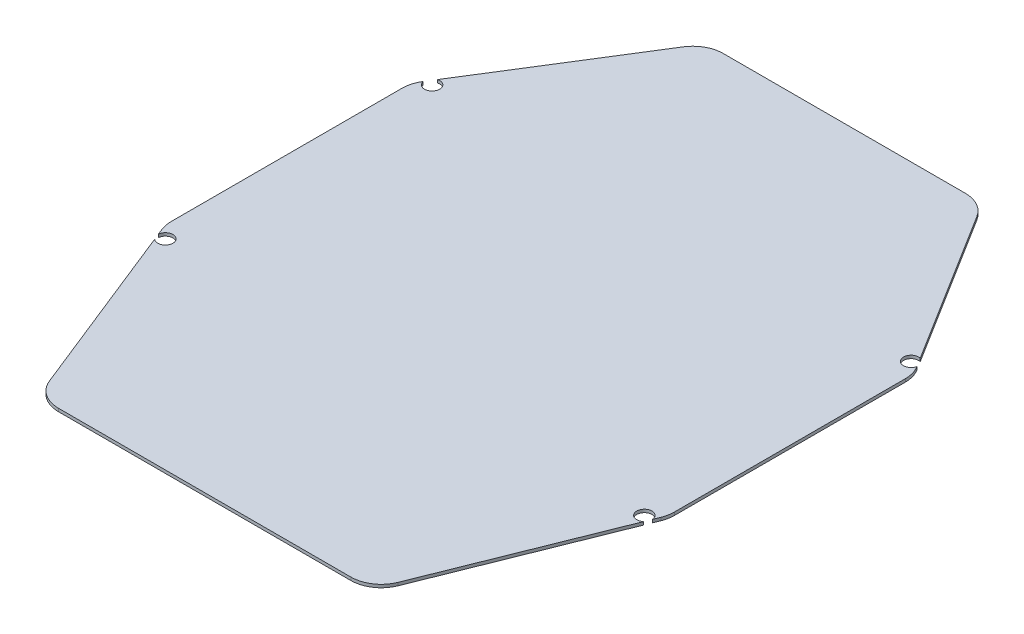
ISO-10303-21;
HEADER;
FILE_DESCRIPTION(('STEP AP214'),'2;1');
FILE_NAME('part.step','',(''),(''),'','','');
FILE_SCHEMA(('AUTOMOTIVE_DESIGN { 1 0 10303 214 1 1 1 1 }'));
ENDSEC;
DATA;
#1=APPLICATION_CONTEXT('core data for automotive mechanical design processes');
#2=APPLICATION_PROTOCOL_DEFINITION('international standard','automotive_design',2000,#1);
#3=PRODUCT_CONTEXT('',#1,'mechanical');
#4=PRODUCT('Part','Part','',(#3));
#5=PRODUCT_RELATED_PRODUCT_CATEGORY('part','',(#4));
#6=PRODUCT_DEFINITION_FORMATION('','',#4);
#7=PRODUCT_DEFINITION_CONTEXT('part definition',#1,'design');
#8=PRODUCT_DEFINITION('design','',#6,#7);
#9=PRODUCT_DEFINITION_SHAPE('','',#8);
#10=(LENGTH_UNIT() NAMED_UNIT(*) SI_UNIT(.MILLI.,.METRE.));
#11=(NAMED_UNIT(*) PLANE_ANGLE_UNIT() SI_UNIT($,.RADIAN.));
#12=(NAMED_UNIT(*) SI_UNIT($,.STERADIAN.) SOLID_ANGLE_UNIT());
#13=UNCERTAINTY_MEASURE_WITH_UNIT(LENGTH_MEASURE(1.E-05),#10,'distance_accuracy_value','');
#14=(GEOMETRIC_REPRESENTATION_CONTEXT(3) GLOBAL_UNCERTAINTY_ASSIGNED_CONTEXT((#13)) GLOBAL_UNIT_ASSIGNED_CONTEXT((#10,
#11,#12)) REPRESENTATION_CONTEXT('',''));
#15=CARTESIAN_POINT('',(0.,0.,0.));
#16=DIRECTION('',(0.,0.,1.));
#17=DIRECTION('',(1.,0.,0.));
#18=AXIS2_PLACEMENT_3D('',#15,#16,#17);
#19=CARTESIAN_POINT('',(81.4799830400509,1.,-47.9320271359186));
#20=DIRECTION('',(-0.847998304005088,0.,0.52999894000318));
#21=DIRECTION('',(0.52999894000318,0.,0.847998304005088));
#22=AXIS2_PLACEMENT_3D('',#19,#20,#21);
#23=PLANE('',#22);
#24=DIRECTION('',(-0.52999894000318,0.,-0.847998304005088));
#25=VECTOR('',#24,1.);
#26=CARTESIAN_POINT('',(81.4799830400509,0.,-47.9320271359186));
#27=LINE('',#26,#25);
#28=CARTESIAN_POINT('',(81.4799830400509,0.,-47.9320271359186));
#29=VERTEX_POINT('',#28);
#30=CARTESIAN_POINT('',(81.4418787234434,0.,-47.9929940424907));
#31=VERTEX_POINT('',#30);
#32=EDGE_CURVE('E231',#29,#31,#27,.T.);
#33=ORIENTED_EDGE('',*,*,#32,.T.);
#34=DIRECTION('',(0.,1.,0.));
#35=VECTOR('',#34,1.);
#36=CARTESIAN_POINT('',(81.4418787234434,0.,-47.9929940424907));
#37=LINE('',#36,#35);
#38=CARTESIAN_POINT('',(81.4418787234434,1.,-47.9929940424907));
#39=VERTEX_POINT('',#38);
#40=EDGE_CURVE('E59',#31,#39,#37,.T.);
#41=ORIENTED_EDGE('',*,*,#40,.T.);
#42=DIRECTION('',(-0.52999894000318,0.,-0.847998304005088));
#43=VECTOR('',#42,1.);
#44=CARTESIAN_POINT('',(81.4799830400509,1.,-47.9320271359186));
#45=LINE('',#44,#43);
#46=CARTESIAN_POINT('',(81.4799830400509,1.,-47.9320271359186));
#47=VERTEX_POINT('',#46);
#48=EDGE_CURVE('E375',#47,#39,#45,.T.);
#49=ORIENTED_EDGE('',*,*,#48,.F.);
#50=DIRECTION('',(0.,-1.,0.));
#51=VECTOR('',#50,1.);
#52=CARTESIAN_POINT('',(81.4799830400509,1.,-47.9320271359186));
#53=LINE('',#52,#51);
#54=EDGE_CURVE('E334',#47,#29,#53,.T.);
#55=ORIENTED_EDGE('',*,*,#54,.T.);
#56=EDGE_LOOP('',(#33,#41,#49,#55));
#57=FACE_BOUND('',#56,.T.);
#58=ADVANCED_FACE('F43',(#57),#23,.F.);
#59=CARTESIAN_POINT('',(-48.4375066249802,1.,-100.799989400032));
#60=DIRECTION('',(0.847998304005088,0.,0.52999894000318));
#61=DIRECTION('',(0.52999894000318,0.,-0.847998304005088));
#62=AXIS2_PLACEMENT_3D('',#59,#60,#61);
#63=PLANE('',#62);
#64=DIRECTION('',(-0.52999894000318,0.,0.847998304005088));
#65=VECTOR('',#64,1.);
#66=CARTESIAN_POINT('',(-48.4375066249802,0.,-100.799989400032));
#67=LINE('',#66,#65);
#68=CARTESIAN_POINT('',(-48.4375066249802,0.,-100.799989400032));
#69=VERTEX_POINT('',#68);
#70=CARTESIAN_POINT('',(-79.5882957612491,0.,-50.9587267820014));
#71=VERTEX_POINT('',#70);
#72=EDGE_CURVE('E249',#69,#71,#67,.T.);
#73=ORIENTED_EDGE('',*,*,#72,.T.);
#74=DIRECTION('',(0.,1.,0.));
#75=VECTOR('',#74,1.);
#76=CARTESIAN_POINT('',(-79.5882957612491,0.,-50.9587267820014));
#77=LINE('',#76,#75);
#78=CARTESIAN_POINT('',(-79.5882957612491,1.,-50.9587267820014));
#79=VERTEX_POINT('',#78);
#80=EDGE_CURVE('E67',#71,#79,#77,.T.);
#81=ORIENTED_EDGE('',*,*,#80,.T.);
#82=DIRECTION('',(-0.52999894000318,0.,0.847998304005088));
#83=VECTOR('',#82,1.);
#84=CARTESIAN_POINT('',(-48.4375066249802,1.,-100.799989400032));
#85=LINE('',#84,#83);
#86=CARTESIAN_POINT('',(-48.4375066249802,1.,-100.799989400032));
#87=VERTEX_POINT('',#86);
#88=EDGE_CURVE('E358',#87,#79,#85,.T.);
#89=ORIENTED_EDGE('',*,*,#88,.F.);
#90=DIRECTION('',(0.,-1.,0.));
#91=VECTOR('',#90,1.);
#92=CARTESIAN_POINT('',(-48.4375066249802,1.,-100.799989400032));
#93=LINE('',#92,#91);
#94=EDGE_CURVE('E319',#87,#69,#93,.T.);
#95=ORIENTED_EDGE('',*,*,#94,.T.);
#96=EDGE_LOOP('',(#73,#81,#89,#95));
#97=FACE_BOUND('',#96,.T.);
#98=ADVANCED_FACE('F354',(#97),#63,.F.);
#99=CARTESIAN_POINT('',(-82.2847669088526,1.,37.2880827278686));
#100=DIRECTION('',(0.92847669088526,0.,-0.371390676354104));
#101=DIRECTION('',(-0.371390676354104,0.,-0.928476690885259));
#102=AXIS2_PLACEMENT_3D('',#99,#100,#101);
#103=PLANE('',#102);
#104=DIRECTION('',(0.371390676354104,0.,0.928476690885259));
#105=VECTOR('',#104,1.);
#106=CARTESIAN_POINT('',(-82.2847669088526,0.,37.2880827278686));
#107=LINE('',#106,#105);
#108=CARTESIAN_POINT('',(-82.2847669088526,0.,37.2880827278686));
#109=VERTEX_POINT('',#108);
#110=CARTESIAN_POINT('',(-81.4919177142516,0.,39.270205714371));
#111=VERTEX_POINT('',#110);
#112=EDGE_CURVE('E263',#109,#111,#107,.T.);
#113=ORIENTED_EDGE('',*,*,#112,.T.);
#114=DIRECTION('',(0.,1.,0.));
#115=VECTOR('',#114,1.);
#116=CARTESIAN_POINT('',(-81.4919177142516,0.,39.270205714371));
#117=LINE('',#116,#115);
#118=CARTESIAN_POINT('',(-81.4919177142516,1.,39.270205714371));
#119=VERTEX_POINT('',#118);
#120=EDGE_CURVE('E457',#111,#119,#117,.T.);
#121=ORIENTED_EDGE('',*,*,#120,.T.);
#122=DIRECTION('',(0.371390676354104,0.,0.928476690885259));
#123=VECTOR('',#122,1.);
#124=CARTESIAN_POINT('',(-82.2847669088526,1.,37.2880827278686));
#125=LINE('',#124,#123);
#126=CARTESIAN_POINT('',(-82.2847669088526,1.,37.2880827278686));
#127=VERTEX_POINT('',#126);
#128=EDGE_CURVE('E399',#127,#119,#125,.T.);
#129=ORIENTED_EDGE('',*,*,#128,.F.);
#130=DIRECTION('',(0.,-1.,0.));
#131=VECTOR('',#130,1.);
#132=CARTESIAN_POINT('',(-82.2847669088526,1.,37.2880827278686));
#133=LINE('',#132,#131);
#134=EDGE_CURVE('E303',#127,#109,#133,.T.);
#135=ORIENTED_EDGE('',*,*,#134,.T.);
#136=EDGE_LOOP('',(#113,#121,#129,#135));
#137=FACE_BOUND('',#136,.T.);
#138=ADVANCED_FACE('F483',(#137),#103,.F.);
#139=CARTESIAN_POINT('',(57.5144372945836,1.,99.213906763541));
#140=DIRECTION('',(-0.928476690885259,0.,-0.371390676354104));
#141=DIRECTION('',(-0.371390676354104,0.,0.928476690885259));
#142=AXIS2_PLACEMENT_3D('',#139,#140,#141);
#143=PLANE('',#142);
#144=DIRECTION('',(0.371390676354104,0.,-0.928476690885259));
#145=VECTOR('',#144,1.);
#146=CARTESIAN_POINT('',(57.5144372945836,0.,99.213906763541));
#147=LINE('',#146,#145);
#148=CARTESIAN_POINT('',(57.5144372945836,0.,99.213906763541));
#149=VERTEX_POINT('',#148);
#150=CARTESIAN_POINT('',(80.6659656552516,0.,41.3350858618711));
#151=VERTEX_POINT('',#150);
#152=EDGE_CURVE('E277',#149,#151,#147,.T.);
#153=ORIENTED_EDGE('',*,*,#152,.T.);
#154=DIRECTION('',(0.,1.,0.));
#155=VECTOR('',#154,1.);
#156=CARTESIAN_POINT('',(80.6659656552516,0.,41.3350858618711));
#157=LINE('',#156,#155);
#158=CARTESIAN_POINT('',(80.6659656552516,1.,41.3350858618711));
#159=VERTEX_POINT('',#158);
#160=EDGE_CURVE('E419',#151,#159,#157,.T.);
#161=ORIENTED_EDGE('',*,*,#160,.T.);
#162=DIRECTION('',(0.371390676354104,0.,-0.928476690885259));
#163=VECTOR('',#162,1.);
#164=CARTESIAN_POINT('',(57.5144372945836,1.,99.213906763541));
#165=LINE('',#164,#163);
#166=CARTESIAN_POINT('',(57.5144372945836,1.,99.213906763541));
#167=VERTEX_POINT('',#166);
#168=EDGE_CURVE('E287',#167,#159,#165,.T.);
#169=ORIENTED_EDGE('',*,*,#168,.F.);
#170=DIRECTION('',(0.,-1.,0.));
#171=VECTOR('',#170,1.);
#172=CARTESIAN_POINT('',(57.5144372945836,1.,99.213906763541));
#173=LINE('',#172,#171);
#174=EDGE_CURVE('E286',#167,#149,#173,.T.);
#175=ORIENTED_EDGE('',*,*,#174,.T.);
#176=EDGE_LOOP('',(#153,#161,#169,#175));
#177=FACE_BOUND('',#176,.T.);
#178=ADVANCED_FACE('F539',(#177),#143,.F.);
#179=CARTESIAN_POINT('',(73.,1.,33.5741759643275));
#180=DIRECTION('',(0.,-1.,0.));
#181=DIRECTION('',(0.,0.,-1.));
#182=AXIS2_PLACEMENT_3D('',#179,#180,#181);
#183=CYLINDRICAL_SURFACE('',#182,10.);
#184=CARTESIAN_POINT('',(73.,0.,33.5741759643275));
#185=DIRECTION('',(0.,1.,0.));
#186=DIRECTION('',(0.,0.,1.));
#187=AXIS2_PLACEMENT_3D('',#184,#185,#186);
#188=CIRCLE('',#187,10.);
#189=CARTESIAN_POINT('',(82.2847669088526,0.,37.2880827278686));
#190=VERTEX_POINT('',#189);
#191=CARTESIAN_POINT('',(83.,0.,33.5741759643275));
#192=VERTEX_POINT('',#191);
#193=EDGE_CURVE('E416',#190,#192,#188,.T.);
#194=ORIENTED_EDGE('',*,*,#193,.T.);
#195=DIRECTION('',(0.,-1.,0.));
#196=VECTOR('',#195,1.);
#197=CARTESIAN_POINT('',(83.,1.,33.5741759643275));
#198=LINE('',#197,#196);
#199=CARTESIAN_POINT('',(83.,1.,33.5741759643275));
#200=VERTEX_POINT('',#199);
#201=EDGE_CURVE('E213',#200,#192,#198,.T.);
#202=ORIENTED_EDGE('',*,*,#201,.F.);
#203=CARTESIAN_POINT('',(73.,1.,33.5741759643275));
#204=DIRECTION('',(0.,1.,0.));
#205=DIRECTION('',(0.,0.,1.));
#206=AXIS2_PLACEMENT_3D('',#203,#204,#205);
#207=CIRCLE('',#206,10.);
#208=CARTESIAN_POINT('',(82.2847669088526,1.,37.2880827278686));
#209=VERTEX_POINT('',#208);
#210=EDGE_CURVE('E281',#209,#200,#207,.T.);
#211=ORIENTED_EDGE('',*,*,#210,.F.);
#212=DIRECTION('',(0.,-1.,0.));
#213=VECTOR('',#212,1.);
#214=CARTESIAN_POINT('',(82.2847669088526,1.,37.2880827278686));
#215=LINE('',#214,#213);
#216=EDGE_CURVE('E282',#209,#190,#215,.T.);
#217=ORIENTED_EDGE('',*,*,#216,.T.);
#218=EDGE_LOOP('',(#194,#202,#211,#217));
#219=FACE_BOUND('',#218,.T.);
#220=ADVANCED_FACE('F45',(#219),#183,.T.);
#221=CARTESIAN_POINT('',(83.,1.,33.5741759643275));
#222=DIRECTION('',(-1.,0.,0.));
#223=DIRECTION('',(0.,0.,1.));
#224=AXIS2_PLACEMENT_3D('',#221,#222,#223);
#225=PLANE('',#224);
#226=DIRECTION('',(0.,0.,-1.));
#227=VECTOR('',#226,1.);
#228=CARTESIAN_POINT('',(83.,0.,33.5741759643275));
#229=LINE('',#228,#227);
#230=CARTESIAN_POINT('',(83.,0.,-42.6320377358867));
#231=VERTEX_POINT('',#230);
#232=EDGE_CURVE('E236',#192,#231,#229,.T.);
#233=ORIENTED_EDGE('',*,*,#232,.T.);
#234=DIRECTION('',(0.,-1.,0.));
#235=VECTOR('',#234,1.);
#236=CARTESIAN_POINT('',(83.,1.,-42.6320377358867));
#237=LINE('',#236,#235);
#238=CARTESIAN_POINT('',(83.,1.,-42.6320377358867));
#239=VERTEX_POINT('',#238);
#240=EDGE_CURVE('E338',#239,#231,#237,.T.);
#241=ORIENTED_EDGE('',*,*,#240,.F.);
#242=DIRECTION('',(0.,0.,-1.));
#243=VECTOR('',#242,1.);
#244=CARTESIAN_POINT('',(83.,1.,33.5741759643275));
#245=LINE('',#244,#243);
#246=EDGE_CURVE('E437',#200,#239,#245,.T.);
#247=ORIENTED_EDGE('',*,*,#246,.F.);
#248=ORIENTED_EDGE('',*,*,#201,.T.);
#249=EDGE_LOOP('',(#233,#241,#247,#248));
#250=FACE_BOUND('',#249,.T.);
#251=ADVANCED_FACE('F423',(#250),#225,.F.);
#252=CARTESIAN_POINT('',(73.,1.,-42.6320377358868));
#253=DIRECTION('',(0.,-1.,0.));
#254=DIRECTION('',(0.,0.,-1.));
#255=AXIS2_PLACEMENT_3D('',#252,#253,#254);
#256=CYLINDRICAL_SURFACE('',#255,10.);
#257=CARTESIAN_POINT('',(73.,0.,-42.6320377358868));
#258=DIRECTION('',(0.,1.,0.));
#259=DIRECTION('',(0.,0.,1.));
#260=AXIS2_PLACEMENT_3D('',#257,#258,#259);
#261=CIRCLE('',#260,10.);
#262=EDGE_CURVE('E232',#231,#29,#261,.T.);
#263=ORIENTED_EDGE('',*,*,#262,.T.);
#264=ORIENTED_EDGE('',*,*,#54,.F.);
#265=CARTESIAN_POINT('',(73.,1.,-42.6320377358868));
#266=DIRECTION('',(0.,1.,0.));
#267=DIRECTION('',(0.,0.,1.));
#268=AXIS2_PLACEMENT_3D('',#265,#266,#267);
#269=CIRCLE('',#268,10.);
#270=EDGE_CURVE('E431',#239,#47,#269,.T.);
#271=ORIENTED_EDGE('',*,*,#270,.F.);
#272=ORIENTED_EDGE('',*,*,#240,.T.);
#273=EDGE_LOOP('',(#263,#264,#271,#272));
#274=FACE_BOUND('',#273,.T.);
#275=ADVANCED_FACE('F429',(#274),#256,.T.);
#276=CARTESIAN_POINT('',(79.5882957612491,1.,-50.9587267820014));
#277=VERTEX_POINT('',#276);
#278=CARTESIAN_POINT('',(48.4375066249801,1.,-100.799989400032));
#279=VERTEX_POINT('',#278);
#280=EDGE_CURVE('E221',#277,#279,#45,.T.);
#281=ORIENTED_EDGE('',*,*,#280,.F.);
#282=DIRECTION('',(0.,1.,0.));
#283=VECTOR('',#282,1.);
#284=CARTESIAN_POINT('',(79.5882957612491,0.,-50.9587267820014));
#285=LINE('',#284,#283);
#286=CARTESIAN_POINT('',(79.5882957612491,0.,-50.9587267820014));
#287=VERTEX_POINT('',#286);
#288=EDGE_CURVE('E205',#277,#287,#285,.F.);
#289=ORIENTED_EDGE('',*,*,#288,.T.);
#290=CARTESIAN_POINT('',(48.4375066249801,0.,-100.799989400032));
#291=VERTEX_POINT('',#290);
#292=EDGE_CURVE('E219',#287,#291,#27,.T.);
#293=ORIENTED_EDGE('',*,*,#292,.T.);
#294=DIRECTION('',(0.,-1.,0.));
#295=VECTOR('',#294,1.);
#296=CARTESIAN_POINT('',(48.4375066249801,1.,-100.799989400032));
#297=LINE('',#296,#295);
#298=EDGE_CURVE('E331',#279,#291,#297,.T.);
#299=ORIENTED_EDGE('',*,*,#298,.F.);
#300=EDGE_LOOP('',(#281,#289,#293,#299));
#301=FACE_BOUND('',#300,.T.);
#302=ADVANCED_FACE('F217',(#301),#23,.F.);
#303=CARTESIAN_POINT('',(39.9575235849292,1.,-95.5));
#304=DIRECTION('',(0.,-1.,0.));
#305=DIRECTION('',(0.,0.,-1.));
#306=AXIS2_PLACEMENT_3D('',#303,#304,#305);
#307=CYLINDRICAL_SURFACE('',#306,10.);
#308=CARTESIAN_POINT('',(39.9575235849292,0.,-95.5));
#309=DIRECTION('',(0.,1.,0.));
#310=DIRECTION('',(0.,0.,1.));
#311=AXIS2_PLACEMENT_3D('',#308,#309,#310);
#312=CIRCLE('',#311,10.);
#313=CARTESIAN_POINT('',(39.9575235849292,0.,-105.5));
#314=VERTEX_POINT('',#313);
#315=EDGE_CURVE('E229',#291,#314,#312,.T.);
#316=ORIENTED_EDGE('',*,*,#315,.T.);
#317=DIRECTION('',(0.,-1.,0.));
#318=VECTOR('',#317,1.);
#319=CARTESIAN_POINT('',(39.9575235849292,1.,-105.5));
#320=LINE('',#319,#318);
#321=CARTESIAN_POINT('',(39.9575235849292,1.,-105.5));
#322=VERTEX_POINT('',#321);
#323=EDGE_CURVE('E327',#322,#314,#320,.T.);
#324=ORIENTED_EDGE('',*,*,#323,.F.);
#325=CARTESIAN_POINT('',(39.9575235849292,1.,-95.5));
#326=DIRECTION('',(0.,1.,0.));
#327=DIRECTION('',(0.,0.,1.));
#328=AXIS2_PLACEMENT_3D('',#325,#326,#327);
#329=CIRCLE('',#328,10.);
#330=EDGE_CURVE('E372',#279,#322,#329,.T.);
#331=ORIENTED_EDGE('',*,*,#330,.F.);
#332=ORIENTED_EDGE('',*,*,#298,.T.);
#333=EDGE_LOOP('',(#316,#324,#331,#332));
#334=FACE_BOUND('',#333,.T.);
#335=ADVANCED_FACE('F371',(#334),#307,.T.);
#336=CARTESIAN_POINT('',(39.9575235849292,1.,-105.5));
#337=DIRECTION('',(0.,0.,1.));
#338=DIRECTION('',(1.,0.,0.));
#339=AXIS2_PLACEMENT_3D('',#336,#337,#338);
#340=PLANE('',#339);
#341=DIRECTION('',(-1.,0.,0.));
#342=VECTOR('',#341,1.);
#343=CARTESIAN_POINT('',(39.9575235849292,0.,-105.5));
#344=LINE('',#343,#342);
#345=CARTESIAN_POINT('',(-39.9575235849292,0.,-105.5));
#346=VERTEX_POINT('',#345);
#347=EDGE_CURVE('E242',#314,#346,#344,.T.);
#348=ORIENTED_EDGE('',*,*,#347,.T.);
#349=DIRECTION('',(0.,-1.,0.));
#350=VECTOR('',#349,1.);
#351=CARTESIAN_POINT('',(-39.9575235849292,1.,-105.5));
#352=LINE('',#351,#350);
#353=CARTESIAN_POINT('',(-39.9575235849292,1.,-105.5));
#354=VERTEX_POINT('',#353);
#355=EDGE_CURVE('E323',#354,#346,#352,.T.);
#356=ORIENTED_EDGE('',*,*,#355,.F.);
#357=DIRECTION('',(-1.,0.,0.));
#358=VECTOR('',#357,1.);
#359=CARTESIAN_POINT('',(39.9575235849292,1.,-105.5));
#360=LINE('',#359,#358);
#361=EDGE_CURVE('E368',#322,#354,#360,.T.);
#362=ORIENTED_EDGE('',*,*,#361,.F.);
#363=ORIENTED_EDGE('',*,*,#323,.T.);
#364=EDGE_LOOP('',(#348,#356,#362,#363));
#365=FACE_BOUND('',#364,.T.);
#366=ADVANCED_FACE('F365',(#365),#340,.F.);
#367=CARTESIAN_POINT('',(-39.9575235849293,1.,-95.5));
#368=DIRECTION('',(0.,-1.,0.));
#369=DIRECTION('',(0.,0.,-1.));
#370=AXIS2_PLACEMENT_3D('',#367,#368,#369);
#371=CYLINDRICAL_SURFACE('',#370,10.);
#372=CARTESIAN_POINT('',(-39.9575235849293,0.,-95.5));
#373=DIRECTION('',(0.,1.,0.));
#374=DIRECTION('',(0.,0.,1.));
#375=AXIS2_PLACEMENT_3D('',#372,#373,#374);
#376=CIRCLE('',#375,10.);
#377=EDGE_CURVE('E245',#346,#69,#376,.T.);
#378=ORIENTED_EDGE('',*,*,#377,.T.);
#379=ORIENTED_EDGE('',*,*,#94,.F.);
#380=CARTESIAN_POINT('',(-39.9575235849293,1.,-95.5));
#381=DIRECTION('',(0.,1.,0.));
#382=DIRECTION('',(0.,0.,1.));
#383=AXIS2_PLACEMENT_3D('',#380,#381,#382);
#384=CIRCLE('',#383,10.);
#385=EDGE_CURVE('E362',#354,#87,#384,.T.);
#386=ORIENTED_EDGE('',*,*,#385,.F.);
#387=ORIENTED_EDGE('',*,*,#355,.T.);
#388=EDGE_LOOP('',(#378,#379,#386,#387));
#389=FACE_BOUND('',#388,.T.);
#390=ADVANCED_FACE('F361',(#389),#371,.T.);
#391=CARTESIAN_POINT('',(-81.4418787234434,1.,-47.9929940424906));
#392=VERTEX_POINT('',#391);
#393=CARTESIAN_POINT('',(-81.4799830400509,1.,-47.9320271359186));
#394=VERTEX_POINT('',#393);
#395=EDGE_CURVE('E386',#392,#394,#85,.T.);
#396=ORIENTED_EDGE('',*,*,#395,.F.);
#397=DIRECTION('',(0.,1.,0.));
#398=VECTOR('',#397,1.);
#399=CARTESIAN_POINT('',(-81.4418787234434,0.,-47.9929940424906));
#400=LINE('',#399,#398);
#401=CARTESIAN_POINT('',(-81.4418787234434,0.,-47.9929940424906));
#402=VERTEX_POINT('',#401);
#403=EDGE_CURVE('E454',#392,#402,#400,.F.);
#404=ORIENTED_EDGE('',*,*,#403,.T.);
#405=CARTESIAN_POINT('',(-81.4799830400509,0.,-47.9320271359186));
#406=VERTEX_POINT('',#405);
#407=EDGE_CURVE('E248',#402,#406,#67,.T.);
#408=ORIENTED_EDGE('',*,*,#407,.T.);
#409=DIRECTION('',(0.,-1.,0.));
#410=VECTOR('',#409,1.);
#411=CARTESIAN_POINT('',(-81.4799830400509,1.,-47.9320271359186));
#412=LINE('',#411,#410);
#413=EDGE_CURVE('E315',#394,#406,#412,.T.);
#414=ORIENTED_EDGE('',*,*,#413,.F.);
#415=EDGE_LOOP('',(#396,#404,#408,#414));
#416=FACE_BOUND('',#415,.T.);
#417=ADVANCED_FACE('F507',(#416),#63,.F.);
#418=CARTESIAN_POINT('',(-73.,1.,-42.6320377358868));
#419=DIRECTION('',(0.,-1.,0.));
#420=DIRECTION('',(0.,0.,-1.));
#421=AXIS2_PLACEMENT_3D('',#418,#419,#420);
#422=CYLINDRICAL_SURFACE('',#421,9.99999999999999);
#423=CARTESIAN_POINT('',(-73.,0.,-42.6320377358868));
#424=DIRECTION('',(0.,1.,0.));
#425=DIRECTION('',(0.,0.,1.));
#426=AXIS2_PLACEMENT_3D('',#423,#424,#425);
#427=CIRCLE('',#426,9.99999999999999);
#428=CARTESIAN_POINT('',(-83.,0.,-42.6320377358868));
#429=VERTEX_POINT('',#428);
#430=EDGE_CURVE('E253',#406,#429,#427,.T.);
#431=ORIENTED_EDGE('',*,*,#430,.T.);
#432=DIRECTION('',(0.,-1.,0.));
#433=VECTOR('',#432,1.);
#434=CARTESIAN_POINT('',(-83.,1.,-42.6320377358868));
#435=LINE('',#434,#433);
#436=CARTESIAN_POINT('',(-83.,1.,-42.6320377358868));
#437=VERTEX_POINT('',#436);
#438=EDGE_CURVE('E311',#437,#429,#435,.T.);
#439=ORIENTED_EDGE('',*,*,#438,.F.);
#440=CARTESIAN_POINT('',(-73.,1.,-42.6320377358868));
#441=DIRECTION('',(0.,1.,0.));
#442=DIRECTION('',(0.,0.,1.));
#443=AXIS2_PLACEMENT_3D('',#440,#441,#442);
#444=CIRCLE('',#443,9.99999999999999);
#445=EDGE_CURVE('E389',#394,#437,#444,.T.);
#446=ORIENTED_EDGE('',*,*,#445,.F.);
#447=ORIENTED_EDGE('',*,*,#413,.T.);
#448=EDGE_LOOP('',(#431,#439,#446,#447));
#449=FACE_BOUND('',#448,.T.);
#450=ADVANCED_FACE('F509',(#449),#422,.T.);
#451=CARTESIAN_POINT('',(-83.,1.,-42.6320377358868));
#452=DIRECTION('',(1.,0.,0.));
#453=DIRECTION('',(0.,0.,-1.));
#454=AXIS2_PLACEMENT_3D('',#451,#452,#453);
#455=PLANE('',#454);
#456=DIRECTION('',(0.,0.,1.));
#457=VECTOR('',#456,1.);
#458=CARTESIAN_POINT('',(-83.,0.,-42.6320377358868));
#459=LINE('',#458,#457);
#460=CARTESIAN_POINT('',(-83.,0.,33.5741759643275));
#461=VERTEX_POINT('',#460);
#462=EDGE_CURVE('E256',#429,#461,#459,.T.);
#463=ORIENTED_EDGE('',*,*,#462,.T.);
#464=DIRECTION('',(0.,-1.,0.));
#465=VECTOR('',#464,1.);
#466=CARTESIAN_POINT('',(-83.,1.,33.5741759643275));
#467=LINE('',#466,#465);
#468=CARTESIAN_POINT('',(-83.,1.,33.5741759643275));
#469=VERTEX_POINT('',#468);
#470=EDGE_CURVE('E307',#469,#461,#467,.T.);
#471=ORIENTED_EDGE('',*,*,#470,.F.);
#472=DIRECTION('',(0.,0.,1.));
#473=VECTOR('',#472,1.);
#474=CARTESIAN_POINT('',(-83.,1.,-42.6320377358868));
#475=LINE('',#474,#473);
#476=EDGE_CURVE('E392',#437,#469,#475,.T.);
#477=ORIENTED_EDGE('',*,*,#476,.F.);
#478=ORIENTED_EDGE('',*,*,#438,.T.);
#479=EDGE_LOOP('',(#463,#471,#477,#478));
#480=FACE_BOUND('',#479,.T.);
#481=ADVANCED_FACE('F511',(#480),#455,.F.);
#482=CARTESIAN_POINT('',(-73.,1.,33.5741759643275));
#483=DIRECTION('',(0.,-1.,0.));
#484=DIRECTION('',(0.,0.,-1.));
#485=AXIS2_PLACEMENT_3D('',#482,#483,#484);
#486=CYLINDRICAL_SURFACE('',#485,9.99999999999999);
#487=CARTESIAN_POINT('',(-73.,0.,33.5741759643275));
#488=DIRECTION('',(0.,1.,0.));
#489=DIRECTION('',(0.,0.,1.));
#490=AXIS2_PLACEMENT_3D('',#487,#488,#489);
#491=CIRCLE('',#490,9.99999999999999);
#492=EDGE_CURVE('E259',#461,#109,#491,.T.);
#493=ORIENTED_EDGE('',*,*,#492,.T.);
#494=ORIENTED_EDGE('',*,*,#134,.F.);
#495=CARTESIAN_POINT('',(-73.,1.,33.5741759643275));
#496=DIRECTION('',(0.,1.,0.));
#497=DIRECTION('',(0.,0.,1.));
#498=AXIS2_PLACEMENT_3D('',#495,#496,#497);
#499=CIRCLE('',#498,9.99999999999999);
#500=EDGE_CURVE('E395',#469,#127,#499,.T.);
#501=ORIENTED_EDGE('',*,*,#500,.F.);
#502=ORIENTED_EDGE('',*,*,#470,.T.);
#503=EDGE_LOOP('',(#493,#494,#501,#502));
#504=FACE_BOUND('',#503,.T.);
#505=ADVANCED_FACE('F490',(#504),#486,.T.);
#506=CARTESIAN_POINT('',(-80.6659656552516,1.,41.335085861871));
#507=VERTEX_POINT('',#506);
#508=CARTESIAN_POINT('',(-57.5144372945836,1.,99.213906763541));
#509=VERTEX_POINT('',#508);
#510=EDGE_CURVE('E398',#507,#509,#125,.T.);
#511=ORIENTED_EDGE('',*,*,#510,.F.);
#512=DIRECTION('',(0.,1.,0.));
#513=VECTOR('',#512,1.);
#514=CARTESIAN_POINT('',(-80.6659656552516,0.,41.335085861871));
#515=LINE('',#514,#513);
#516=CARTESIAN_POINT('',(-80.6659656552516,0.,41.335085861871));
#517=VERTEX_POINT('',#516);
#518=EDGE_CURVE('E461',#507,#517,#515,.F.);
#519=ORIENTED_EDGE('',*,*,#518,.T.);
#520=CARTESIAN_POINT('',(-57.5144372945836,0.,99.213906763541));
#521=VERTEX_POINT('',#520);
#522=EDGE_CURVE('E262',#517,#521,#107,.T.);
#523=ORIENTED_EDGE('',*,*,#522,.T.);
#524=DIRECTION('',(0.,-1.,0.));
#525=VECTOR('',#524,1.);
#526=CARTESIAN_POINT('',(-57.5144372945836,1.,99.213906763541));
#527=LINE('',#526,#525);
#528=EDGE_CURVE('E299',#509,#521,#527,.T.);
#529=ORIENTED_EDGE('',*,*,#528,.F.);
#530=EDGE_LOOP('',(#511,#519,#523,#529));
#531=FACE_BOUND('',#530,.T.);
#532=ADVANCED_FACE('F496',(#531),#103,.F.);
#533=CARTESIAN_POINT('',(-48.229670385731,1.,95.5));
#534=DIRECTION('',(0.,-1.,0.));
#535=DIRECTION('',(0.,0.,-1.));
#536=AXIS2_PLACEMENT_3D('',#533,#534,#535);
#537=CYLINDRICAL_SURFACE('',#536,9.99999999999999);
#538=CARTESIAN_POINT('',(-48.229670385731,0.,95.5));
#539=DIRECTION('',(0.,1.,0.));
#540=DIRECTION('',(0.,0.,1.));
#541=AXIS2_PLACEMENT_3D('',#538,#539,#540);
#542=CIRCLE('',#541,9.99999999999999);
#543=CARTESIAN_POINT('',(-48.229670385731,0.,105.5));
#544=VERTEX_POINT('',#543);
#545=EDGE_CURVE('E267',#521,#544,#542,.T.);
#546=ORIENTED_EDGE('',*,*,#545,.T.);
#547=DIRECTION('',(0.,-1.,0.));
#548=VECTOR('',#547,1.);
#549=CARTESIAN_POINT('',(-48.229670385731,1.,105.5));
#550=LINE('',#549,#548);
#551=CARTESIAN_POINT('',(-48.229670385731,1.,105.5));
#552=VERTEX_POINT('',#551);
#553=EDGE_CURVE('E295',#552,#544,#550,.T.);
#554=ORIENTED_EDGE('',*,*,#553,.F.);
#555=CARTESIAN_POINT('',(-48.229670385731,1.,95.5));
#556=DIRECTION('',(0.,1.,0.));
#557=DIRECTION('',(0.,0.,1.));
#558=AXIS2_PLACEMENT_3D('',#555,#556,#557);
#559=CIRCLE('',#558,9.99999999999999);
#560=EDGE_CURVE('E403',#509,#552,#559,.T.);
#561=ORIENTED_EDGE('',*,*,#560,.F.);
#562=ORIENTED_EDGE('',*,*,#528,.T.);
#563=EDGE_LOOP('',(#546,#554,#561,#562));
#564=FACE_BOUND('',#563,.T.);
#565=ADVANCED_FACE('F570',(#564),#537,.T.);
#566=CARTESIAN_POINT('',(-48.229670385731,1.,105.5));
#567=DIRECTION('',(0.,0.,-1.));
#568=DIRECTION('',(-1.,0.,0.));
#569=AXIS2_PLACEMENT_3D('',#566,#567,#568);
#570=PLANE('',#569);
#571=DIRECTION('',(1.,0.,0.));
#572=VECTOR('',#571,1.);
#573=CARTESIAN_POINT('',(-48.229670385731,0.,105.5));
#574=LINE('',#573,#572);
#575=CARTESIAN_POINT('',(48.2296703857309,0.,105.5));
#576=VERTEX_POINT('',#575);
#577=EDGE_CURVE('E270',#544,#576,#574,.T.);
#578=ORIENTED_EDGE('',*,*,#577,.T.);
#579=DIRECTION('',(0.,-1.,0.));
#580=VECTOR('',#579,1.);
#581=CARTESIAN_POINT('',(48.2296703857309,1.,105.5));
#582=LINE('',#581,#580);
#583=CARTESIAN_POINT('',(48.2296703857309,1.,105.5));
#584=VERTEX_POINT('',#583);
#585=EDGE_CURVE('E291',#584,#576,#582,.T.);
#586=ORIENTED_EDGE('',*,*,#585,.F.);
#587=DIRECTION('',(1.,0.,0.));
#588=VECTOR('',#587,1.);
#589=CARTESIAN_POINT('',(-48.229670385731,1.,105.5));
#590=LINE('',#589,#588);
#591=EDGE_CURVE('E406',#552,#584,#590,.T.);
#592=ORIENTED_EDGE('',*,*,#591,.F.);
#593=ORIENTED_EDGE('',*,*,#553,.T.);
#594=EDGE_LOOP('',(#578,#586,#592,#593));
#595=FACE_BOUND('',#594,.T.);
#596=ADVANCED_FACE('F567',(#595),#570,.F.);
#597=CARTESIAN_POINT('',(48.229670385731,1.,95.5));
#598=DIRECTION('',(0.,-1.,0.));
#599=DIRECTION('',(0.,0.,-1.));
#600=AXIS2_PLACEMENT_3D('',#597,#598,#599);
#601=CYLINDRICAL_SURFACE('',#600,10.);
#602=CARTESIAN_POINT('',(48.229670385731,0.,95.5));
#603=DIRECTION('',(0.,1.,0.));
#604=DIRECTION('',(0.,0.,1.));
#605=AXIS2_PLACEMENT_3D('',#602,#603,#604);
#606=CIRCLE('',#605,10.);
#607=EDGE_CURVE('E273',#576,#149,#606,.T.);
#608=ORIENTED_EDGE('',*,*,#607,.T.);
#609=ORIENTED_EDGE('',*,*,#174,.F.);
#610=CARTESIAN_POINT('',(48.229670385731,1.,95.5));
#611=DIRECTION('',(0.,1.,0.));
#612=DIRECTION('',(0.,0.,1.));
#613=AXIS2_PLACEMENT_3D('',#610,#611,#612);
#614=CIRCLE('',#613,10.);
#615=EDGE_CURVE('E409',#584,#167,#614,.T.);
#616=ORIENTED_EDGE('',*,*,#615,.F.);
#617=ORIENTED_EDGE('',*,*,#585,.T.);
#618=EDGE_LOOP('',(#608,#609,#616,#617));
#619=FACE_BOUND('',#618,.T.);
#620=ADVANCED_FACE('F563',(#619),#601,.T.);
#621=CARTESIAN_POINT('',(81.4919177142516,1.,39.2702057143709));
#622=VERTEX_POINT('',#621);
#623=EDGE_CURVE('E412',#622,#209,#165,.T.);
#624=ORIENTED_EDGE('',*,*,#623,.F.);
#625=DIRECTION('',(0.,1.,0.));
#626=VECTOR('',#625,1.);
#627=CARTESIAN_POINT('',(81.4919177142516,0.,39.2702057143709));
#628=LINE('',#627,#626);
#629=CARTESIAN_POINT('',(81.4919177142516,0.,39.2702057143709));
#630=VERTEX_POINT('',#629);
#631=EDGE_CURVE('E448',#622,#630,#628,.F.);
#632=ORIENTED_EDGE('',*,*,#631,.T.);
#633=EDGE_CURVE('E276',#630,#190,#147,.T.);
#634=ORIENTED_EDGE('',*,*,#633,.T.);
#635=ORIENTED_EDGE('',*,*,#216,.F.);
#636=EDGE_LOOP('',(#624,#632,#634,#635));
#637=FACE_BOUND('',#636,.T.);
#638=ADVANCED_FACE('F546',(#637),#143,.F.);
#639=CARTESIAN_POINT('',(73.,1.,33.5741759643275));
#640=DIRECTION('',(0.,1.,0.));
#641=DIRECTION('',(0.,0.,1.));
#642=AXIS2_PLACEMENT_3D('',#639,#640,#641);
#643=PLANE('',#642);
#644=CARTESIAN_POINT('',(79.,1.,39.4710691142204));
#645=DIRECTION('',(0.,1.,0.));
#646=DIRECTION('',(0.,0.,1.));
#647=AXIS2_PLACEMENT_3D('',#644,#645,#646);
#648=CIRCLE('',#647,2.50000000000001);
#649=EDGE_CURVE('E469',#622,#159,#648,.T.);
#650=ORIENTED_EDGE('',*,*,#649,.F.);
#651=ORIENTED_EDGE('',*,*,#623,.T.);
#652=ORIENTED_EDGE('',*,*,#210,.T.);
#653=ORIENTED_EDGE('',*,*,#246,.T.);
#654=ORIENTED_EDGE('',*,*,#270,.T.);
#655=ORIENTED_EDGE('',*,*,#48,.T.);
#656=CARTESIAN_POINT('',(79.,1.,-48.5289308857796));
#657=DIRECTION('',(0.,1.,0.));
#658=DIRECTION('',(0.,0.,1.));
#659=AXIS2_PLACEMENT_3D('',#656,#657,#658);
#660=CIRCLE('',#659,2.5);
#661=EDGE_CURVE('E223',#277,#39,#660,.T.);
#662=ORIENTED_EDGE('',*,*,#661,.F.);
#663=ORIENTED_EDGE('',*,*,#280,.T.);
#664=ORIENTED_EDGE('',*,*,#330,.T.);
#665=ORIENTED_EDGE('',*,*,#361,.T.);
#666=ORIENTED_EDGE('',*,*,#385,.T.);
#667=ORIENTED_EDGE('',*,*,#88,.T.);
#668=CARTESIAN_POINT('',(-79.,1.,-48.5289308857796));
#669=DIRECTION('',(0.,1.,0.));
#670=DIRECTION('',(0.,0.,1.));
#671=AXIS2_PLACEMENT_3D('',#668,#669,#670);
#672=CIRCLE('',#671,2.5);
#673=EDGE_CURVE('E470',#392,#79,#672,.T.);
#674=ORIENTED_EDGE('',*,*,#673,.F.);
#675=ORIENTED_EDGE('',*,*,#395,.T.);
#676=ORIENTED_EDGE('',*,*,#445,.T.);
#677=ORIENTED_EDGE('',*,*,#476,.T.);
#678=ORIENTED_EDGE('',*,*,#500,.T.);
#679=ORIENTED_EDGE('',*,*,#128,.T.);
#680=CARTESIAN_POINT('',(-79.,1.,39.4710691142204));
#681=DIRECTION('',(0.,1.,0.));
#682=DIRECTION('',(0.,0.,1.));
#683=AXIS2_PLACEMENT_3D('',#680,#681,#682);
#684=CIRCLE('',#683,2.5);
#685=EDGE_CURVE('E473',#507,#119,#684,.T.);
#686=ORIENTED_EDGE('',*,*,#685,.F.);
#687=ORIENTED_EDGE('',*,*,#510,.T.);
#688=ORIENTED_EDGE('',*,*,#560,.T.);
#689=ORIENTED_EDGE('',*,*,#591,.T.);
#690=ORIENTED_EDGE('',*,*,#615,.T.);
#691=ORIENTED_EDGE('',*,*,#168,.T.);
#692=EDGE_LOOP('',(#650,#651,#652,#653,#654,#655,#662,#663,#664,#665,#666,#667,#674,#675,#676,
#677,#678,#679,#686,#687,#688,#689,#690,#691));
#693=FACE_BOUND('',#692,.T.);
#694=ADVANCED_FACE('F435',(#693),#643,.T.);
#695=CARTESIAN_POINT('',(73.,0.,33.5741759643275));
#696=DIRECTION('',(0.,1.,0.));
#697=DIRECTION('',(0.,0.,1.));
#698=AXIS2_PLACEMENT_3D('',#695,#696,#697);
#699=PLANE('',#698);
#700=ORIENTED_EDGE('',*,*,#633,.F.);
#701=CARTESIAN_POINT('',(79.,0.,39.4710691142204));
#702=DIRECTION('',(0.,1.,0.));
#703=DIRECTION('',(0.,0.,1.));
#704=AXIS2_PLACEMENT_3D('',#701,#702,#703);
#705=CIRCLE('',#704,2.50000000000001);
#706=EDGE_CURVE('E11',#630,#151,#705,.T.);
#707=ORIENTED_EDGE('',*,*,#706,.T.);
#708=ORIENTED_EDGE('',*,*,#152,.F.);
#709=ORIENTED_EDGE('',*,*,#607,.F.);
#710=ORIENTED_EDGE('',*,*,#577,.F.);
#711=ORIENTED_EDGE('',*,*,#545,.F.);
#712=ORIENTED_EDGE('',*,*,#522,.F.);
#713=CARTESIAN_POINT('',(-79.,0.,39.4710691142204));
#714=DIRECTION('',(0.,1.,0.));
#715=DIRECTION('',(0.,0.,1.));
#716=AXIS2_PLACEMENT_3D('',#713,#714,#715);
#717=CIRCLE('',#716,2.5);
#718=EDGE_CURVE('E212',#517,#111,#717,.T.);
#719=ORIENTED_EDGE('',*,*,#718,.T.);
#720=ORIENTED_EDGE('',*,*,#112,.F.);
#721=ORIENTED_EDGE('',*,*,#492,.F.);
#722=ORIENTED_EDGE('',*,*,#462,.F.);
#723=ORIENTED_EDGE('',*,*,#430,.F.);
#724=ORIENTED_EDGE('',*,*,#407,.F.);
#725=CARTESIAN_POINT('',(-79.,0.,-48.5289308857796));
#726=DIRECTION('',(0.,1.,0.));
#727=DIRECTION('',(0.,0.,1.));
#728=AXIS2_PLACEMENT_3D('',#725,#726,#727);
#729=CIRCLE('',#728,2.5);
#730=EDGE_CURVE('E52',#402,#71,#729,.T.);
#731=ORIENTED_EDGE('',*,*,#730,.T.);
#732=ORIENTED_EDGE('',*,*,#72,.F.);
#733=ORIENTED_EDGE('',*,*,#377,.F.);
#734=ORIENTED_EDGE('',*,*,#347,.F.);
#735=ORIENTED_EDGE('',*,*,#315,.F.);
#736=ORIENTED_EDGE('',*,*,#292,.F.);
#737=CARTESIAN_POINT('',(79.,0.,-48.5289308857796));
#738=DIRECTION('',(0.,1.,0.));
#739=DIRECTION('',(0.,0.,1.));
#740=AXIS2_PLACEMENT_3D('',#737,#738,#739);
#741=CIRCLE('',#740,2.5);
#742=EDGE_CURVE('E202',#287,#31,#741,.T.);
#743=ORIENTED_EDGE('',*,*,#742,.T.);
#744=ORIENTED_EDGE('',*,*,#32,.F.);
#745=ORIENTED_EDGE('',*,*,#262,.F.);
#746=ORIENTED_EDGE('',*,*,#232,.F.);
#747=ORIENTED_EDGE('',*,*,#193,.F.);
#748=EDGE_LOOP('',(#700,#707,#708,#709,#710,#711,#712,#719,#720,#721,#722,#723,#724,#731,#732,
#733,#734,#735,#736,#743,#744,#745,#746,#747));
#749=FACE_BOUND('',#748,.T.);
#750=ADVANCED_FACE('F227',(#749),#699,.F.);
#751=CARTESIAN_POINT('',(79.,0.,-48.5289308857796));
#752=DIRECTION('',(0.,1.,0.));
#753=DIRECTION('',(0.,0.,1.));
#754=AXIS2_PLACEMENT_3D('',#751,#752,#753);
#755=CYLINDRICAL_SURFACE('',#754,2.5);
#756=ORIENTED_EDGE('',*,*,#742,.F.);
#757=ORIENTED_EDGE('',*,*,#288,.F.);
#758=ORIENTED_EDGE('',*,*,#661,.T.);
#759=ORIENTED_EDGE('',*,*,#40,.F.);
#760=EDGE_LOOP('',(#756,#757,#758,#759));
#761=FACE_BOUND('',#760,.T.);
#762=ADVANCED_FACE('F204',(#761),#755,.F.);
#763=CARTESIAN_POINT('',(-79.,0.,39.4710691142204));
#764=DIRECTION('',(0.,1.,0.));
#765=DIRECTION('',(0.,0.,1.));
#766=AXIS2_PLACEMENT_3D('',#763,#764,#765);
#767=CYLINDRICAL_SURFACE('',#766,2.5);
#768=ORIENTED_EDGE('',*,*,#718,.F.);
#769=ORIENTED_EDGE('',*,*,#518,.F.);
#770=ORIENTED_EDGE('',*,*,#685,.T.);
#771=ORIENTED_EDGE('',*,*,#120,.F.);
#772=EDGE_LOOP('',(#768,#769,#770,#771));
#773=FACE_BOUND('',#772,.T.);
#774=ADVANCED_FACE('F479',(#773),#767,.F.);
#775=CARTESIAN_POINT('',(-79.,0.,-48.5289308857796));
#776=DIRECTION('',(0.,1.,0.));
#777=DIRECTION('',(0.,0.,1.));
#778=AXIS2_PLACEMENT_3D('',#775,#776,#777);
#779=CYLINDRICAL_SURFACE('',#778,2.5);
#780=ORIENTED_EDGE('',*,*,#730,.F.);
#781=ORIENTED_EDGE('',*,*,#403,.F.);
#782=ORIENTED_EDGE('',*,*,#673,.T.);
#783=ORIENTED_EDGE('',*,*,#80,.F.);
#784=EDGE_LOOP('',(#780,#781,#782,#783));
#785=FACE_BOUND('',#784,.T.);
#786=ADVANCED_FACE('F589',(#785),#779,.F.);
#787=CARTESIAN_POINT('',(79.,0.,39.4710691142204));
#788=DIRECTION('',(0.,1.,0.));
#789=DIRECTION('',(0.,0.,1.));
#790=AXIS2_PLACEMENT_3D('',#787,#788,#789);
#791=CYLINDRICAL_SURFACE('',#790,2.50000000000001);
#792=ORIENTED_EDGE('',*,*,#706,.F.);
#793=ORIENTED_EDGE('',*,*,#631,.F.);
#794=ORIENTED_EDGE('',*,*,#649,.T.);
#795=ORIENTED_EDGE('',*,*,#160,.F.);
#796=EDGE_LOOP('',(#792,#793,#794,#795));
#797=FACE_BOUND('',#796,.T.);
#798=ADVANCED_FACE('F556',(#797),#791,.F.);
#799=CLOSED_SHELL('',(#58,#98,#138,#178,#220,#251,#275,#302,#335,#366,#390,#417,#450,#481,#505,
#532,#565,#596,#620,#638,#694,#750,#762,#774,#786,#798));
#800=MANIFOLD_SOLID_BREP('B2',#799);
#801=ADVANCED_BREP_SHAPE_REPRESENTATION('',(#18,#800),#14);
#802=SHAPE_DEFINITION_REPRESENTATION(#9,#801);
ENDSEC;
END-ISO-10303-21;
